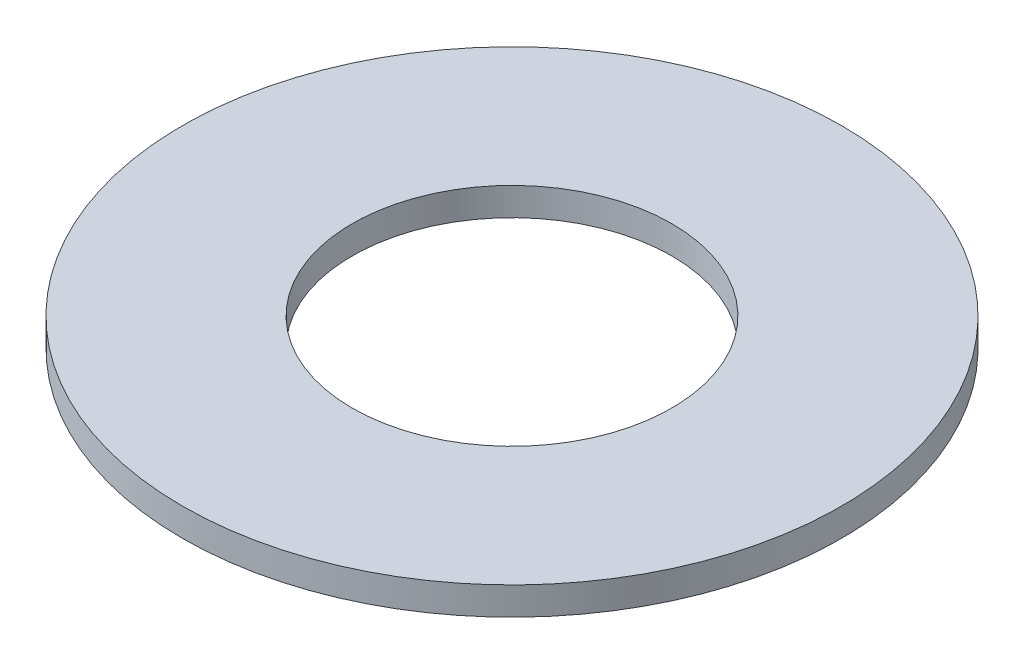
ISO-10303-21;
HEADER;
FILE_DESCRIPTION(('STEP AP214'),'2;1');
FILE_NAME('part.step','',(''),(''),'','','');
FILE_SCHEMA(('AUTOMOTIVE_DESIGN { 1 0 10303 214 1 1 1 1 }'));
ENDSEC;
DATA;
#1=APPLICATION_CONTEXT('core data for automotive mechanical design processes');
#2=APPLICATION_PROTOCOL_DEFINITION('international standard','automotive_design',2000,#1);
#3=PRODUCT_CONTEXT('',#1,'mechanical');
#4=PRODUCT('Part','Part','',(#3));
#5=PRODUCT_RELATED_PRODUCT_CATEGORY('part','',(#4));
#6=PRODUCT_DEFINITION_FORMATION('','',#4);
#7=PRODUCT_DEFINITION_CONTEXT('part definition',#1,'design');
#8=PRODUCT_DEFINITION('design','',#6,#7);
#9=PRODUCT_DEFINITION_SHAPE('','',#8);
#10=(LENGTH_UNIT() NAMED_UNIT(*) SI_UNIT(.MILLI.,.METRE.));
#11=(NAMED_UNIT(*) PLANE_ANGLE_UNIT() SI_UNIT($,.RADIAN.));
#12=(NAMED_UNIT(*) SI_UNIT($,.STERADIAN.) SOLID_ANGLE_UNIT());
#13=UNCERTAINTY_MEASURE_WITH_UNIT(LENGTH_MEASURE(1.E-05),#10,'distance_accuracy_value','');
#14=(GEOMETRIC_REPRESENTATION_CONTEXT(3) GLOBAL_UNCERTAINTY_ASSIGNED_CONTEXT((#13)) GLOBAL_UNIT_ASSIGNED_CONTEXT((#10,
#11,#12)) REPRESENTATION_CONTEXT('',''));
#15=CARTESIAN_POINT('',(0.,0.,0.));
#16=DIRECTION('',(0.,0.,1.));
#17=DIRECTION('',(1.,0.,0.));
#18=AXIS2_PLACEMENT_3D('',#15,#16,#17);
#19=CARTESIAN_POINT('',(0.,7.,0.));
#20=DIRECTION('',(0.,-1.,0.));
#21=DIRECTION('',(0.,0.,-1.));
#22=AXIS2_PLACEMENT_3D('',#19,#20,#21);
#23=CYLINDRICAL_SURFACE('',#22,82.5);
#24=CARTESIAN_POINT('',(0.,7.,0.));
#25=DIRECTION('',(0.,1.,0.));
#26=DIRECTION('',(0.,0.,1.));
#27=AXIS2_PLACEMENT_3D('',#24,#25,#26);
#28=CIRCLE('',#27,82.5);
#29=CARTESIAN_POINT('',(0.,7.,82.5));
#30=VERTEX_POINT('',#29);
#31=EDGE_CURVE('E10',#30,#30,#28,.T.);
#32=ORIENTED_EDGE('',*,*,#31,.F.);
#33=EDGE_LOOP('',(#32));
#34=FACE_BOUND('',#33,.T.);
#35=CARTESIAN_POINT('',(0.,0.,0.));
#36=DIRECTION('',(0.,1.,0.));
#37=DIRECTION('',(0.,0.,1.));
#38=AXIS2_PLACEMENT_3D('',#35,#36,#37);
#39=CIRCLE('',#38,82.5);
#40=CARTESIAN_POINT('',(0.,0.,82.5));
#41=VERTEX_POINT('',#40);
#42=EDGE_CURVE('E37',#41,#41,#39,.T.);
#43=ORIENTED_EDGE('',*,*,#42,.T.);
#44=EDGE_LOOP('',(#43));
#45=FACE_BOUND('',#44,.T.);
#46=ADVANCED_FACE('F40',(#34,#45),#23,.T.);
#47=CARTESIAN_POINT('',(0.,7.,0.));
#48=DIRECTION('',(0.,1.,0.));
#49=DIRECTION('',(0.,0.,1.));
#50=AXIS2_PLACEMENT_3D('',#47,#48,#49);
#51=PLANE('',#50);
#52=CARTESIAN_POINT('',(0.,7.,0.));
#53=DIRECTION('',(0.,1.,0.));
#54=DIRECTION('',(0.,0.,1.));
#55=AXIS2_PLACEMENT_3D('',#52,#53,#54);
#56=CIRCLE('',#55,40.);
#57=CARTESIAN_POINT('',(0.,7.,40.));
#58=VERTEX_POINT('',#57);
#59=EDGE_CURVE('E50',#58,#58,#56,.T.);
#60=ORIENTED_EDGE('',*,*,#59,.F.);
#61=EDGE_LOOP('',(#60));
#62=FACE_BOUND('',#61,.T.);
#63=ORIENTED_EDGE('',*,*,#31,.T.);
#64=EDGE_LOOP('',(#63));
#65=FACE_BOUND('',#64,.T.);
#66=ADVANCED_FACE('F59',(#62,#65),#51,.T.);
#67=CARTESIAN_POINT('',(0.,0.,0.));
#68=DIRECTION('',(0.,1.,0.));
#69=DIRECTION('',(0.,0.,1.));
#70=AXIS2_PLACEMENT_3D('',#67,#68,#69);
#71=PLANE('',#70);
#72=CARTESIAN_POINT('',(0.,0.,0.));
#73=DIRECTION('',(0.,1.,0.));
#74=DIRECTION('',(0.,0.,1.));
#75=AXIS2_PLACEMENT_3D('',#72,#73,#74);
#76=CIRCLE('',#75,40.);
#77=CARTESIAN_POINT('',(0.,0.,40.));
#78=VERTEX_POINT('',#77);
#79=EDGE_CURVE('E47',#78,#78,#76,.T.);
#80=ORIENTED_EDGE('',*,*,#79,.T.);
#81=EDGE_LOOP('',(#80));
#82=FACE_BOUND('',#81,.T.);
#83=ORIENTED_EDGE('',*,*,#42,.F.);
#84=EDGE_LOOP('',(#83));
#85=FACE_BOUND('',#84,.T.);
#86=ADVANCED_FACE('F58',(#82,#85),#71,.F.);
#87=CARTESIAN_POINT('',(0.,7.,0.));
#88=DIRECTION('',(0.,-1.,0.));
#89=DIRECTION('',(0.,0.,-1.));
#90=AXIS2_PLACEMENT_3D('',#87,#88,#89);
#91=CYLINDRICAL_SURFACE('',#90,40.);
#92=ORIENTED_EDGE('',*,*,#59,.T.);
#93=EDGE_LOOP('',(#92));
#94=FACE_BOUND('',#93,.T.);
#95=ORIENTED_EDGE('',*,*,#79,.F.);
#96=EDGE_LOOP('',(#95));
#97=FACE_BOUND('',#96,.T.);
#98=ADVANCED_FACE('F54',(#94,#97),#91,.F.);
#99=CLOSED_SHELL('',(#46,#66,#86,#98));
#100=MANIFOLD_SOLID_BREP('B2',#99);
#101=ADVANCED_BREP_SHAPE_REPRESENTATION('',(#18,#100),#14);
#102=SHAPE_DEFINITION_REPRESENTATION(#9,#101);
ENDSEC;
END-ISO-10303-21;
